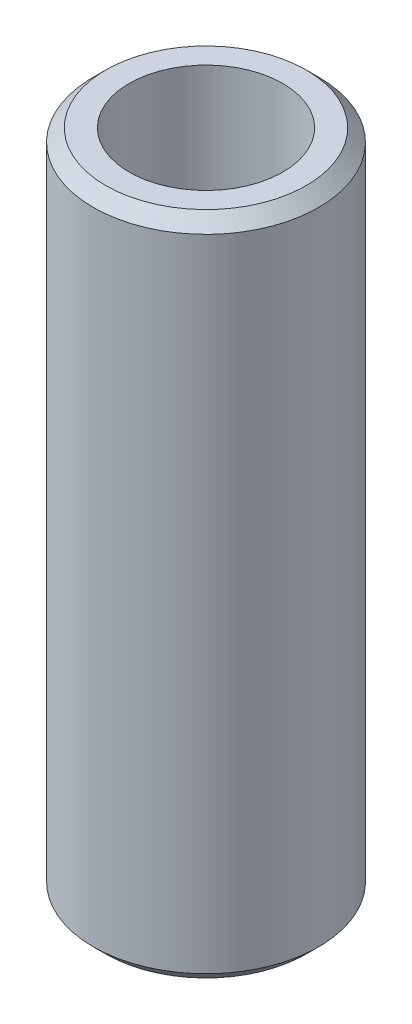
ISO-10303-21;
HEADER;
FILE_DESCRIPTION(('STEP AP214'),'2;1');
FILE_NAME('part.step','',(''),(''),'','','');
FILE_SCHEMA(('AUTOMOTIVE_DESIGN { 1 0 10303 214 1 1 1 1 }'));
ENDSEC;
DATA;
#1=APPLICATION_CONTEXT('core data for automotive mechanical design processes');
#2=APPLICATION_PROTOCOL_DEFINITION('international standard','automotive_design',2000,#1);
#3=PRODUCT_CONTEXT('',#1,'mechanical');
#4=PRODUCT('Part','Part','',(#3));
#5=PRODUCT_RELATED_PRODUCT_CATEGORY('part','',(#4));
#6=PRODUCT_DEFINITION_FORMATION('','',#4);
#7=PRODUCT_DEFINITION_CONTEXT('part definition',#1,'design');
#8=PRODUCT_DEFINITION('design','',#6,#7);
#9=PRODUCT_DEFINITION_SHAPE('','',#8);
#10=(LENGTH_UNIT() NAMED_UNIT(*) SI_UNIT(.MILLI.,.METRE.));
#11=(NAMED_UNIT(*) PLANE_ANGLE_UNIT() SI_UNIT($,.RADIAN.));
#12=(NAMED_UNIT(*) SI_UNIT($,.STERADIAN.) SOLID_ANGLE_UNIT());
#13=UNCERTAINTY_MEASURE_WITH_UNIT(LENGTH_MEASURE(1.E-05),#10,'distance_accuracy_value','');
#14=(GEOMETRIC_REPRESENTATION_CONTEXT(3) GLOBAL_UNCERTAINTY_ASSIGNED_CONTEXT((#13)) GLOBAL_UNIT_ASSIGNED_CONTEXT((#10,
#11,#12)) REPRESENTATION_CONTEXT('',''));
#15=CARTESIAN_POINT('',(0.,0.,0.));
#16=DIRECTION('',(0.,0.,1.));
#17=DIRECTION('',(1.,0.,0.));
#18=AXIS2_PLACEMENT_3D('',#15,#16,#17);
#19=CARTESIAN_POINT('',(0.,309.801256567815,0.));
#20=DIRECTION('',(0.,-1.,0.));
#21=DIRECTION('',(0.,0.,-1.));
#22=AXIS2_PLACEMENT_3D('',#19,#20,#21);
#23=CYLINDRICAL_SURFACE('',#22,52.5);
#24=CARTESIAN_POINT('',(0.,303.945776238415,0.));
#25=DIRECTION('',(0.,1.,0.));
#26=DIRECTION('',(0.,0.,1.));
#27=AXIS2_PLACEMENT_3D('',#24,#25,#26);
#28=CIRCLE('',#27,52.5);
#29=CARTESIAN_POINT('',(0.,303.945776238415,-52.5));
#30=VERTEX_POINT('',#29);
#31=EDGE_CURVE('E50',#30,#30,#28,.F.);
#32=CARTESIAN_POINT('',(0.,5.8554803294002,0.));
#33=DIRECTION('',(0.,1.,0.));
#34=DIRECTION('',(0.,0.,1.));
#35=AXIS2_PLACEMENT_3D('',#32,#33,#34);
#36=CIRCLE('',#35,52.5);
#37=CARTESIAN_POINT('',(0.,5.8554803294002,-52.5));
#38=VERTEX_POINT('',#37);
#39=EDGE_CURVE('E51',#38,#38,#36,.T.);
#40=CARTESIAN_POINT('',(0.,303.945776238415,-52.5));
#41=CARTESIAN_POINT('',(0.,300.840668989363,-52.5));
#42=CARTESIAN_POINT('',(0.,297.735561740311,-52.5));
#43=CARTESIAN_POINT('',(0.,291.525347242206,-52.5));
#44=CARTESIAN_POINT('',(0.,288.420239993154,-52.5));
#45=CARTESIAN_POINT('',(0.,282.21002549505,-52.5));
#46=CARTESIAN_POINT('',(0.,279.104918245997,-52.5));
#47=CARTESIAN_POINT('',(0.,272.894703747893,-52.5));
#48=CARTESIAN_POINT('',(0.,269.789596498841,-52.5));
#49=CARTESIAN_POINT('',(0.,263.579382000736,-52.5));
#50=CARTESIAN_POINT('',(0.,260.474274751684,-52.5));
#51=CARTESIAN_POINT('',(0.,254.26406025358,-52.5));
#52=CARTESIAN_POINT('',(0.,251.158953004527,-52.5));
#53=CARTESIAN_POINT('',(0.,244.948738506423,-52.5));
#54=CARTESIAN_POINT('',(0.,241.843631257371,-52.5));
#55=CARTESIAN_POINT('',(0.,235.633416759266,-52.5));
#56=CARTESIAN_POINT('',(0.,232.528309510214,-52.5));
#57=CARTESIAN_POINT('',(0.,226.318095012109,-52.5));
#58=CARTESIAN_POINT('',(0.,223.212987763057,-52.5));
#59=CARTESIAN_POINT('',(0.,217.002773264953,-52.5));
#60=CARTESIAN_POINT('',(0.,213.8976660159,-52.5));
#61=CARTESIAN_POINT('',(0.,207.687451517796,-52.5));
#62=CARTESIAN_POINT('',(0.,204.582344268744,-52.5));
#63=CARTESIAN_POINT('',(0.,198.372129770639,-52.5));
#64=CARTESIAN_POINT('',(0.,195.267022521587,-52.5));
#65=CARTESIAN_POINT('',(0.,189.056808023482,-52.5));
#66=CARTESIAN_POINT('',(0.,185.95170077443,-52.5));
#67=CARTESIAN_POINT('',(0.,179.741486276326,-52.5));
#68=CARTESIAN_POINT('',(0.,176.636379027274,-52.5));
#69=CARTESIAN_POINT('',(0.,170.426164529169,-52.5));
#70=CARTESIAN_POINT('',(0.,167.321057280117,-52.5));
#71=CARTESIAN_POINT('',(0.,161.110842782012,-52.5));
#72=CARTESIAN_POINT('',(0.,158.00573553296,-52.5));
#73=CARTESIAN_POINT('',(0.,151.795521034856,-52.5));
#74=CARTESIAN_POINT('',(0.,148.690413785803,-52.5));
#75=CARTESIAN_POINT('',(0.,142.480199287699,-52.5));
#76=CARTESIAN_POINT('',(0.,139.375092038647,-52.5));
#77=CARTESIAN_POINT('',(0.,133.164877540542,-52.5));
#78=CARTESIAN_POINT('',(0.,130.05977029149,-52.5));
#79=CARTESIAN_POINT('',(0.,123.849555793385,-52.5));
#80=CARTESIAN_POINT('',(0.,120.744448544333,-52.5));
#81=CARTESIAN_POINT('',(0.,114.534234046229,-52.5));
#82=CARTESIAN_POINT('',(0.,111.429126797176,-52.5));
#83=CARTESIAN_POINT('',(0.,105.218912299072,-52.5));
#84=CARTESIAN_POINT('',(0.,102.11380505002,-52.5));
#85=CARTESIAN_POINT('',(0.,95.9035905519152,-52.5));
#86=CARTESIAN_POINT('',(0.,92.798483302863,-52.5));
#87=CARTESIAN_POINT('',(0.,86.5882688047585,-52.5));
#88=CARTESIAN_POINT('',(0.,83.4831615557062,-52.5));
#89=CARTESIAN_POINT('',(0.,77.2729470576018,-52.5));
#90=CARTESIAN_POINT('',(0.,74.1678398085495,-52.5));
#91=CARTESIAN_POINT('',(0.,67.9576253104451,-52.5));
#92=CARTESIAN_POINT('',(0.,64.8525180613928,-52.5));
#93=CARTESIAN_POINT('',(0.,58.6423035632883,-52.5));
#94=CARTESIAN_POINT('',(0.,55.5371963142361,-52.5));
#95=CARTESIAN_POINT('',(0.,49.3269818161316,-52.5));
#96=CARTESIAN_POINT('',(0.,46.2218745670793,-52.5));
#97=CARTESIAN_POINT('',(0.,40.0116600689749,-52.5));
#98=CARTESIAN_POINT('',(0.,36.9065528199226,-52.5));
#99=CARTESIAN_POINT('',(0.,30.6963383218181,-52.5));
#100=CARTESIAN_POINT('',(0.,27.5912310727659,-52.5));
#101=CARTESIAN_POINT('',(0.,21.3810165746614,-52.5));
#102=CARTESIAN_POINT('',(0.,18.2759093256091,-52.5));
#103=CARTESIAN_POINT('',(0.,12.0656948275047,-52.5));
#104=CARTESIAN_POINT('',(0.,8.96058757845244,-52.5));
#105=CARTESIAN_POINT('',(0.,5.8554803294002,-52.5));
#106=B_SPLINE_CURVE_WITH_KNOTS('',3,(#40,#41,#42,#43,#44,#45,#46,#47,#48,#49,#50,#51,#52,#53,
#54,#55,#56,#57,#58,#59,#60,#61,#62,#63,#64,#65,#66,#67,#68,#69,#70,#71,#72,#73,#74,#75,#76,#77,
#78,#79,#80,#81,#82,#83,#84,#85,#86,#87,#88,#89,#90,#91,#92,#93,#94,#95,#96,#97,#98,#99,#100,
#101,#102,#103,#104,#105),.UNSPECIFIED.,.F.,.F.,(4,2,2,2,2,2,2,2,2,2,2,2,2,2,2,2,2,2,2,2,2,2,2,
2,2,2,2,2,2,2,2,2,4),(0.,9.31532174715671,18.6306434943134,27.9459652414701,37.2612869886268,
46.5766087357836,55.8919304829403,65.207252230097,74.5225739772538,83.8378957244105,
93.1532174715672,102.468539218724,111.783860965881,121.099182713037,130.414504460194,
139.729826207351,149.045147954508,158.360469701664,167.675791448821,176.991113195978,
186.306434943134,195.621756690291,204.937078437448,214.252400184605,223.567721931761,
232.883043678918,242.198365426075,251.513687173232,260.829008920388,270.144330667545,
279.459652414702,288.774974161858,298.090295909015),.UNSPECIFIED.);
#107=EDGE_CURVE('BSEAM39',#30,#38,#106,.T.);
#108=ORIENTED_EDGE('',*,*,#31,.T.);
#109=ORIENTED_EDGE('',*,*,#39,.T.);
#110=ORIENTED_EDGE('',*,*,#107,.T.);
#111=ORIENTED_EDGE('',*,*,#107,.F.);
#112=EDGE_LOOP('',(#108,#110,#109,#111));
#113=FACE_BOUND('',#112,.T.);
#114=ADVANCED_FACE('F39',(#113),#23,.T.);
#115=CARTESIAN_POINT('',(0.,309.801256567815,0.));
#116=DIRECTION('',(0.,1.,0.));
#117=DIRECTION('',(0.,0.,1.));
#118=AXIS2_PLACEMENT_3D('',#115,#116,#117);
#119=PLANE('',#118);
#120=CARTESIAN_POINT('',(0.,309.801256567815,0.));
#121=DIRECTION('',(0.,1.,0.));
#122=DIRECTION('',(0.,0.,1.));
#123=AXIS2_PLACEMENT_3D('',#120,#121,#122);
#124=CIRCLE('',#123,46.6445196706002);
#125=CARTESIAN_POINT('',(0.,309.801256567815,46.6445196706002));
#126=VERTEX_POINT('',#125);
#127=EDGE_CURVE('E54',#126,#126,#124,.T.);
#128=ORIENTED_EDGE('',*,*,#127,.T.);
#129=EDGE_LOOP('',(#128));
#130=FACE_BOUND('',#129,.T.);
#131=CARTESIAN_POINT('',(0.,309.801256567815,0.));
#132=DIRECTION('',(0.,1.,0.));
#133=DIRECTION('',(0.,0.,1.));
#134=AXIS2_PLACEMENT_3D('',#131,#132,#133);
#135=CIRCLE('',#134,35.7660787956015);
#136=CARTESIAN_POINT('',(0.,309.801256567815,-35.7660787956015));
#137=VERTEX_POINT('',#136);
#138=EDGE_CURVE('E58',#137,#137,#135,.T.);
#139=ORIENTED_EDGE('',*,*,#138,.F.);
#140=EDGE_LOOP('',(#139));
#141=FACE_BOUND('',#140,.T.);
#142=ADVANCED_FACE('F69',(#130,#141),#119,.T.);
#143=CARTESIAN_POINT('',(0.,0.,0.));
#144=DIRECTION('',(0.,1.,0.));
#145=DIRECTION('',(0.,0.,1.));
#146=AXIS2_PLACEMENT_3D('',#143,#144,#145);
#147=PLANE('',#146);
#148=CARTESIAN_POINT('',(0.,0.,0.));
#149=DIRECTION('',(0.,1.,0.));
#150=DIRECTION('',(0.,0.,1.));
#151=AXIS2_PLACEMENT_3D('',#148,#149,#150);
#152=CIRCLE('',#151,46.6445196705998);
#153=CARTESIAN_POINT('',(0.,0.,46.6445196705998));
#154=VERTEX_POINT('',#153);
#155=EDGE_CURVE('E10',#154,#154,#152,.F.);
#156=ORIENTED_EDGE('',*,*,#155,.T.);
#157=EDGE_LOOP('',(#156));
#158=FACE_BOUND('',#157,.T.);
#159=CARTESIAN_POINT('',(0.,0.,0.));
#160=DIRECTION('',(0.,1.,0.));
#161=DIRECTION('',(0.,0.,1.));
#162=AXIS2_PLACEMENT_3D('',#159,#160,#161);
#163=CIRCLE('',#162,35.7660787956015);
#164=CARTESIAN_POINT('',(0.,0.,-35.7660787956015));
#165=VERTEX_POINT('',#164);
#166=EDGE_CURVE('E63',#165,#165,#163,.T.);
#167=ORIENTED_EDGE('',*,*,#166,.T.);
#168=EDGE_LOOP('',(#167));
#169=FACE_BOUND('',#168,.T.);
#170=ADVANCED_FACE('F75',(#158,#169),#147,.F.);
#171=CARTESIAN_POINT('',(0.,309.801256567815,0.));
#172=DIRECTION('',(0.,-1.,0.));
#173=DIRECTION('',(0.,0.,-1.));
#174=AXIS2_PLACEMENT_3D('',#171,#172,#173);
#175=CYLINDRICAL_SURFACE('',#174,35.7660787956015);
#176=CARTESIAN_POINT('',(0.,309.801256567815,-35.7660787956015));
#177=CARTESIAN_POINT('',(0.,306.574160145234,-35.7660787956015));
#178=CARTESIAN_POINT('',(0.,303.347063722652,-35.7660787956015));
#179=CARTESIAN_POINT('',(0.,296.89287087749,-35.7660787956015));
#180=CARTESIAN_POINT('',(0.,293.665774454908,-35.7660787956015));
#181=CARTESIAN_POINT('',(0.,287.211581609745,-35.7660787956015));
#182=CARTESIAN_POINT('',(0.,283.984485187164,-35.7660787956015));
#183=CARTESIAN_POINT('',(0.,277.530292342001,-35.7660787956015));
#184=CARTESIAN_POINT('',(0.,274.30319591942,-35.7660787956015));
#185=CARTESIAN_POINT('',(0.,267.849003074257,-35.7660787956015));
#186=CARTESIAN_POINT('',(0.,264.621906651675,-35.7660787956015));
#187=CARTESIAN_POINT('',(0.,258.167713806513,-35.7660787956015));
#188=CARTESIAN_POINT('',(0.,254.940617383931,-35.7660787956015));
#189=CARTESIAN_POINT('',(0.,248.486424538768,-35.7660787956015));
#190=CARTESIAN_POINT('',(0.,245.259328116187,-35.7660787956015));
#191=CARTESIAN_POINT('',(0.,238.805135271024,-35.7660787956015));
#192=CARTESIAN_POINT('',(0.,235.578038848443,-35.7660787956015));
#193=CARTESIAN_POINT('',(0.,229.12384600328,-35.7660787956015));
#194=CARTESIAN_POINT('',(0.,225.896749580699,-35.7660787956015));
#195=CARTESIAN_POINT('',(0.,219.442556735536,-35.7660787956015));
#196=CARTESIAN_POINT('',(0.,216.215460312954,-35.7660787956015));
#197=CARTESIAN_POINT('',(0.,209.761267467792,-35.7660787956015));
#198=CARTESIAN_POINT('',(0.,206.53417104521,-35.7660787956015));
#199=CARTESIAN_POINT('',(0.,200.079978200047,-35.7660787956015));
#200=CARTESIAN_POINT('',(0.,196.852881777466,-35.7660787956015));
#201=CARTESIAN_POINT('',(0.,190.398688932303,-35.7660787956015));
#202=CARTESIAN_POINT('',(0.,187.171592509722,-35.7660787956015));
#203=CARTESIAN_POINT('',(0.,180.717399664559,-35.7660787956015));
#204=CARTESIAN_POINT('',(0.,177.490303241977,-35.7660787956015));
#205=CARTESIAN_POINT('',(0.,171.036110396815,-35.7660787956015));
#206=CARTESIAN_POINT('',(0.,167.809013974233,-35.7660787956015));
#207=CARTESIAN_POINT('',(0.,161.35482112907,-35.7660787956015));
#208=CARTESIAN_POINT('',(0.,158.127724706489,-35.7660787956015));
#209=CARTESIAN_POINT('',(0.,151.673531861326,-35.7660787956015));
#210=CARTESIAN_POINT('',(0.,148.446435438745,-35.7660787956015));
#211=CARTESIAN_POINT('',(0.,141.992242593582,-35.7660787956015));
#212=CARTESIAN_POINT('',(0.,138.765146171001,-35.7660787956015));
#213=CARTESIAN_POINT('',(0.,132.310953325838,-35.7660787956015));
#214=CARTESIAN_POINT('',(0.,129.083856903256,-35.7660787956015));
#215=CARTESIAN_POINT('',(0.,122.629664058094,-35.7660787956015));
#216=CARTESIAN_POINT('',(0.,119.402567635512,-35.7660787956015));
#217=CARTESIAN_POINT('',(0.,112.948374790349,-35.7660787956015));
#218=CARTESIAN_POINT('',(0.,109.721278367768,-35.7660787956015));
#219=CARTESIAN_POINT('',(0.,103.267085522605,-35.7660787956015));
#220=CARTESIAN_POINT('',(0.,100.039989100024,-35.7660787956015));
#221=CARTESIAN_POINT('',(0.,93.5857962548608,-35.7660787956015));
#222=CARTESIAN_POINT('',(0.,90.3586998322794,-35.7660787956015));
#223=CARTESIAN_POINT('',(0.,83.9045069871166,-35.7660787956015));
#224=CARTESIAN_POINT('',(0.,80.6774105645352,-35.7660787956015));
#225=CARTESIAN_POINT('',(0.,74.2232177193724,-35.7660787956015));
#226=CARTESIAN_POINT('',(0.,70.996121296791,-35.7660787956015));
#227=CARTESIAN_POINT('',(0.,64.5419284516282,-35.7660787956015));
#228=CARTESIAN_POINT('',(0.,61.3148320290467,-35.7660787956015));
#229=CARTESIAN_POINT('',(0.,54.860639183884,-35.7660787956015));
#230=CARTESIAN_POINT('',(0.,51.6335427613026,-35.7660787956015));
#231=CARTESIAN_POINT('',(0.,45.1793499161397,-35.7660787956015));
#232=CARTESIAN_POINT('',(0.,41.9522534935583,-35.7660787956015));
#233=CARTESIAN_POINT('',(0.,35.4980606483955,-35.7660787956015));
#234=CARTESIAN_POINT('',(0.,32.2709642258141,-35.7660787956015));
#235=CARTESIAN_POINT('',(0.,25.8167713806513,-35.7660787956015));
#236=CARTESIAN_POINT('',(0.,22.5896749580699,-35.7660787956015));
#237=CARTESIAN_POINT('',(0.,16.1354821129071,-35.7660787956015));
#238=CARTESIAN_POINT('',(0.,12.9083856903257,-35.7660787956015));
#239=CARTESIAN_POINT('',(0.,6.45419284516283,-35.7660787956015));
#240=CARTESIAN_POINT('',(0.,3.22709642258142,-35.7660787956015));
#241=CARTESIAN_POINT('',(0.,0.,-35.7660787956015));
#242=B_SPLINE_CURVE_WITH_KNOTS('',3,(#176,#177,#178,#179,#180,#181,#182,#183,#184,#185,#186,
#187,#188,#189,#190,#191,#192,#193,#194,#195,#196,#197,#198,#199,#200,#201,#202,#203,#204,#205,
#206,#207,#208,#209,#210,#211,#212,#213,#214,#215,#216,#217,#218,#219,#220,#221,#222,#223,#224,
#225,#226,#227,#228,#229,#230,#231,#232,#233,#234,#235,#236,#237,#238,#239,#240,#241),
.UNSPECIFIED.,.F.,.F.,(4,2,2,2,2,2,2,2,2,2,2,2,2,2,2,2,2,2,2,2,2,2,2,2,2,2,2,2,2,2,2,2,4),(0.,
9.68128926774425,19.3625785354885,29.0438678032327,38.725157070977,48.4064463387212,
58.0877356064654,67.7690248742096,77.4503141419539,87.1316034096981,96.8128926774423,
106.494181945187,116.175471212931,125.856760480675,135.538049748419,145.219339016163,
154.900628283908,164.581917551652,174.263206819396,183.94449608714,193.625785354885,
203.307074622629,212.988363890373,222.669653158117,232.350942425861,242.032231693606,
251.71352096135,261.394810229094,271.076099496838,280.757388764583,290.438678032327,
300.119967300071,309.801256567815),.UNSPECIFIED.);
#243=EDGE_CURVE('BSEAM70',#137,#165,#242,.T.);
#244=ORIENTED_EDGE('',*,*,#138,.T.);
#245=ORIENTED_EDGE('',*,*,#166,.F.);
#246=ORIENTED_EDGE('',*,*,#243,.T.);
#247=ORIENTED_EDGE('',*,*,#243,.F.);
#248=EDGE_LOOP('',(#244,#246,#245,#247));
#249=FACE_BOUND('',#248,.T.);
#250=ADVANCED_FACE('F70',(#249),#175,.F.);
#251=CARTESIAN_POINT('',(0.,309.801256567815,0.));
#252=DIRECTION('',(0.,-1.,0.));
#253=DIRECTION('',(0.,0.,-1.));
#254=AXIS2_PLACEMENT_3D('',#251,#252,#253);
#255=CONICAL_SURFACE('',#254,46.6445196706002,0.785398163397448);
#256=ORIENTED_EDGE('',*,*,#31,.F.);
#257=EDGE_LOOP('',(#256));
#258=FACE_BOUND('',#257,.T.);
#259=ORIENTED_EDGE('',*,*,#127,.F.);
#260=EDGE_LOOP('',(#259));
#261=FACE_BOUND('',#260,.T.);
#262=ADVANCED_FACE('F81',(#258,#261),#255,.T.);
#263=CARTESIAN_POINT('',(0.,5.8554803294002,0.));
#264=DIRECTION('',(0.,1.,0.));
#265=DIRECTION('',(0.,0.,1.));
#266=AXIS2_PLACEMENT_3D('',#263,#264,#265);
#267=CONICAL_SURFACE('',#266,52.5,0.78539816339745);
#268=ORIENTED_EDGE('',*,*,#155,.F.);
#269=EDGE_LOOP('',(#268));
#270=FACE_BOUND('',#269,.T.);
#271=ORIENTED_EDGE('',*,*,#39,.F.);
#272=EDGE_LOOP('',(#271));
#273=FACE_BOUND('',#272,.T.);
#274=ADVANCED_FACE('F45',(#270,#273),#267,.T.);
#275=CLOSED_SHELL('',(#114,#142,#170,#250,#262,#274));
#276=MANIFOLD_SOLID_BREP('B2',#275);
#277=ADVANCED_BREP_SHAPE_REPRESENTATION('',(#18,#276),#14);
#278=SHAPE_DEFINITION_REPRESENTATION(#9,#277);
ENDSEC;
END-ISO-10303-21;
